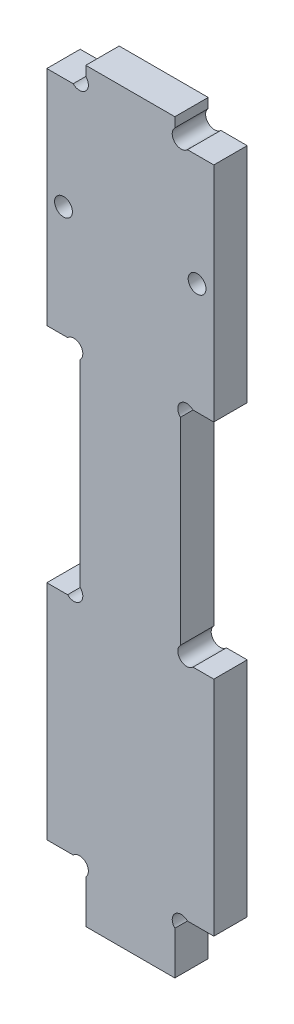
ISO-10303-21;
HEADER;
FILE_DESCRIPTION(('STEP AP214'),'2;1');
FILE_NAME('part.step','',(''),(''),'','','');
FILE_SCHEMA(('AUTOMOTIVE_DESIGN { 1 0 10303 214 1 1 1 1 }'));
ENDSEC;
DATA;
#1=APPLICATION_CONTEXT('core data for automotive mechanical design processes');
#2=APPLICATION_PROTOCOL_DEFINITION('international standard','automotive_design',2000,#1);
#3=PRODUCT_CONTEXT('',#1,'mechanical');
#4=PRODUCT('Part','Part','',(#3));
#5=PRODUCT_RELATED_PRODUCT_CATEGORY('part','',(#4));
#6=PRODUCT_DEFINITION_FORMATION('','',#4);
#7=PRODUCT_DEFINITION_CONTEXT('part definition',#1,'design');
#8=PRODUCT_DEFINITION('design','',#6,#7);
#9=PRODUCT_DEFINITION_SHAPE('','',#8);
#10=(LENGTH_UNIT() NAMED_UNIT(*) SI_UNIT(.MILLI.,.METRE.));
#11=(NAMED_UNIT(*) PLANE_ANGLE_UNIT() SI_UNIT($,.RADIAN.));
#12=(NAMED_UNIT(*) SI_UNIT($,.STERADIAN.) SOLID_ANGLE_UNIT());
#13=UNCERTAINTY_MEASURE_WITH_UNIT(LENGTH_MEASURE(1.E-05),#10,'distance_accuracy_value','');
#14=(GEOMETRIC_REPRESENTATION_CONTEXT(3) GLOBAL_UNCERTAINTY_ASSIGNED_CONTEXT((#13)) GLOBAL_UNIT_ASSIGNED_CONTEXT((#10,
#11,#12)) REPRESENTATION_CONTEXT('',''));
#15=CARTESIAN_POINT('',(0.,0.,0.));
#16=DIRECTION('',(0.,0.,1.));
#17=DIRECTION('',(1.,0.,0.));
#18=AXIS2_PLACEMENT_3D('',#15,#16,#17);
#19=CARTESIAN_POINT('',(24.1313708498985,8.86862915010153,6.));
#20=DIRECTION('',(0.,0.,1.));
#21=DIRECTION('',(1.,0.,0.));
#22=AXIS2_PLACEMENT_3D('',#19,#20,#21);
#23=PLANE('',#22);
#24=CARTESIAN_POINT('',(27.,110.,6.));
#25=DIRECTION('',(0.,0.,1.));
#26=DIRECTION('',(-1.,0.,0.));
#27=AXIS2_PLACEMENT_3D('',#24,#25,#26);
#28=CIRCLE('',#27,1.6);
#29=CARTESIAN_POINT('',(25.4,110.,6.));
#30=VERTEX_POINT('',#29);
#31=EDGE_CURVE('E232',#30,#30,#28,.T.);
#32=ORIENTED_EDGE('',*,*,#31,.F.);
#33=EDGE_LOOP('',(#32));
#34=FACE_BOUND('',#33,.T.);
#35=DIRECTION('',(0.,1.,0.));
#36=VECTOR('',#35,1.);
#37=CARTESIAN_POINT('',(30.,50.,6.));
#38=LINE('',#37,#36);
#39=CARTESIAN_POINT('',(30.,10.,6.));
#40=VERTEX_POINT('',#39);
#41=CARTESIAN_POINT('',(30.,50.,6.));
#42=VERTEX_POINT('',#41);
#43=EDGE_CURVE('E290',#40,#42,#38,.T.);
#44=ORIENTED_EDGE('',*,*,#43,.T.);
#45=DIRECTION('',(-1.,0.,0.));
#46=VECTOR('',#45,1.);
#47=CARTESIAN_POINT('',(26.262741699797,50.,6.));
#48=LINE('',#47,#46);
#49=CARTESIAN_POINT('',(26.262741699797,50.,6.));
#50=VERTEX_POINT('',#49);
#51=EDGE_CURVE('E227',#42,#50,#48,.T.);
#52=ORIENTED_EDGE('',*,*,#51,.T.);
#53=CARTESIAN_POINT('',(25.1313708498985,51.1313708498985,6.));
#54=DIRECTION('',(0.,0.,-1.));
#55=DIRECTION('',(1.,0.,0.));
#56=AXIS2_PLACEMENT_3D('',#53,#54,#55);
#57=CIRCLE('',#56,1.6);
#58=CARTESIAN_POINT('',(24.,52.2627416997969,6.));
#59=VERTEX_POINT('',#58);
#60=EDGE_CURVE('E293',#50,#59,#57,.T.);
#61=ORIENTED_EDGE('',*,*,#60,.T.);
#62=DIRECTION('',(0.,1.,0.));
#63=VECTOR('',#62,1.);
#64=CARTESIAN_POINT('',(24.,87.7372583002031,6.));
#65=LINE('',#64,#63);
#66=CARTESIAN_POINT('',(24.,87.7372583002031,6.));
#67=VERTEX_POINT('',#66);
#68=EDGE_CURVE('E295',#59,#67,#65,.T.);
#69=ORIENTED_EDGE('',*,*,#68,.T.);
#70=CARTESIAN_POINT('',(25.1313708498985,88.8686291501015,6.));
#71=DIRECTION('',(0.,0.,-1.));
#72=DIRECTION('',(-1.,0.,0.));
#73=AXIS2_PLACEMENT_3D('',#70,#71,#72);
#74=CIRCLE('',#73,1.6);
#75=CARTESIAN_POINT('',(26.262741699797,90.,6.));
#76=VERTEX_POINT('',#75);
#77=EDGE_CURVE('E297',#67,#76,#74,.T.);
#78=ORIENTED_EDGE('',*,*,#77,.T.);
#79=DIRECTION('',(1.,0.,0.));
#80=VECTOR('',#79,1.);
#81=CARTESIAN_POINT('',(26.262741699797,90.,6.));
#82=LINE('',#81,#80);
#83=CARTESIAN_POINT('',(30.,90.,6.));
#84=VERTEX_POINT('',#83);
#85=EDGE_CURVE('E299',#76,#84,#82,.T.);
#86=ORIENTED_EDGE('',*,*,#85,.T.);
#87=DIRECTION('',(0.,1.,0.));
#88=VECTOR('',#87,1.);
#89=CARTESIAN_POINT('',(30.,90.,6.));
#90=LINE('',#89,#88);
#91=CARTESIAN_POINT('',(30.,130.,6.));
#92=VERTEX_POINT('',#91);
#93=EDGE_CURVE('E301',#84,#92,#90,.T.);
#94=ORIENTED_EDGE('',*,*,#93,.T.);
#95=DIRECTION('',(-1.,0.,0.));
#96=VECTOR('',#95,1.);
#97=CARTESIAN_POINT('',(25.262741699797,130.,6.));
#98=LINE('',#97,#96);
#99=CARTESIAN_POINT('',(25.262741699797,130.,6.));
#100=VERTEX_POINT('',#99);
#101=EDGE_CURVE('E303',#92,#100,#98,.T.);
#102=ORIENTED_EDGE('',*,*,#101,.T.);
#103=CARTESIAN_POINT('',(24.1313708498985,131.131370849898,6.));
#104=DIRECTION('',(0.,0.,-1.));
#105=DIRECTION('',(-1.,0.,0.));
#106=AXIS2_PLACEMENT_3D('',#103,#104,#105);
#107=CIRCLE('',#106,1.60000000000001);
#108=CARTESIAN_POINT('',(23.,132.262741699797,6.));
#109=VERTEX_POINT('',#108);
#110=EDGE_CURVE('E305',#100,#109,#107,.T.);
#111=ORIENTED_EDGE('',*,*,#110,.T.);
#112=DIRECTION('',(0.,1.,0.));
#113=VECTOR('',#112,1.);
#114=CARTESIAN_POINT('',(23.,132.262741699797,6.));
#115=LINE('',#114,#113);
#116=CARTESIAN_POINT('',(23.,134.,6.));
#117=VERTEX_POINT('',#116);
#118=EDGE_CURVE('E307',#109,#117,#115,.T.);
#119=ORIENTED_EDGE('',*,*,#118,.T.);
#120=DIRECTION('',(-1.,0.,0.));
#121=VECTOR('',#120,1.);
#122=CARTESIAN_POINT('',(6.99999999999998,134.,6.));
#123=LINE('',#122,#121);
#124=CARTESIAN_POINT('',(6.99999999999998,134.,6.));
#125=VERTEX_POINT('',#124);
#126=EDGE_CURVE('E309',#117,#125,#123,.T.);
#127=ORIENTED_EDGE('',*,*,#126,.T.);
#128=DIRECTION('',(0.,-1.,0.));
#129=VECTOR('',#128,1.);
#130=CARTESIAN_POINT('',(6.99999999999998,132.262741699797,6.));
#131=LINE('',#130,#129);
#132=CARTESIAN_POINT('',(6.99999999999998,132.262741699797,6.));
#133=VERTEX_POINT('',#132);
#134=EDGE_CURVE('E311',#125,#133,#131,.T.);
#135=ORIENTED_EDGE('',*,*,#134,.T.);
#136=CARTESIAN_POINT('',(5.8686291501015,131.131370849898,6.));
#137=DIRECTION('',(0.,0.,-1.));
#138=DIRECTION('',(1.,0.,0.));
#139=AXIS2_PLACEMENT_3D('',#136,#137,#138);
#140=CIRCLE('',#139,1.60000000000001);
#141=CARTESIAN_POINT('',(4.73725830020302,130.,6.));
#142=VERTEX_POINT('',#141);
#143=EDGE_CURVE('E313',#133,#142,#140,.T.);
#144=ORIENTED_EDGE('',*,*,#143,.T.);
#145=DIRECTION('',(-1.,0.,0.));
#146=VECTOR('',#145,1.);
#147=CARTESIAN_POINT('',(4.73725830020302,130.,6.));
#148=LINE('',#147,#146);
#149=CARTESIAN_POINT('',(0.,130.,6.));
#150=VERTEX_POINT('',#149);
#151=EDGE_CURVE('E315',#142,#150,#148,.T.);
#152=ORIENTED_EDGE('',*,*,#151,.T.);
#153=DIRECTION('',(0.,-1.,0.));
#154=VECTOR('',#153,1.);
#155=CARTESIAN_POINT('',(0.,90.,6.));
#156=LINE('',#155,#154);
#157=CARTESIAN_POINT('',(0.,90.,6.));
#158=VERTEX_POINT('',#157);
#159=EDGE_CURVE('E317',#150,#158,#156,.T.);
#160=ORIENTED_EDGE('',*,*,#159,.T.);
#161=DIRECTION('',(1.,0.,0.));
#162=VECTOR('',#161,1.);
#163=CARTESIAN_POINT('',(3.73725830020305,90.,6.));
#164=LINE('',#163,#162);
#165=CARTESIAN_POINT('',(3.73725830020305,90.,6.));
#166=VERTEX_POINT('',#165);
#167=EDGE_CURVE('E319',#158,#166,#164,.T.);
#168=ORIENTED_EDGE('',*,*,#167,.T.);
#169=CARTESIAN_POINT('',(4.86862915010152,88.8686291501015,6.));
#170=DIRECTION('',(0.,0.,-1.));
#171=DIRECTION('',(1.,0.,0.));
#172=AXIS2_PLACEMENT_3D('',#169,#170,#171);
#173=CIRCLE('',#172,1.6);
#174=CARTESIAN_POINT('',(6.,87.7372583002031,6.));
#175=VERTEX_POINT('',#174);
#176=EDGE_CURVE('E321',#166,#175,#173,.T.);
#177=ORIENTED_EDGE('',*,*,#176,.T.);
#178=DIRECTION('',(0.,-1.,0.));
#179=VECTOR('',#178,1.);
#180=CARTESIAN_POINT('',(6.,87.7372583002031,6.));
#181=LINE('',#180,#179);
#182=CARTESIAN_POINT('',(6.,52.2627416997969,6.));
#183=VERTEX_POINT('',#182);
#184=EDGE_CURVE('E323',#175,#183,#181,.T.);
#185=ORIENTED_EDGE('',*,*,#184,.T.);
#186=CARTESIAN_POINT('',(4.86862915010152,51.1313708498985,6.));
#187=DIRECTION('',(0.,0.,-1.));
#188=DIRECTION('',(-1.,0.,0.));
#189=AXIS2_PLACEMENT_3D('',#186,#187,#188);
#190=CIRCLE('',#189,1.6);
#191=CARTESIAN_POINT('',(3.73725830020305,50.,6.));
#192=VERTEX_POINT('',#191);
#193=EDGE_CURVE('E325',#183,#192,#190,.T.);
#194=ORIENTED_EDGE('',*,*,#193,.T.);
#195=DIRECTION('',(-1.,0.,0.));
#196=VECTOR('',#195,1.);
#197=CARTESIAN_POINT('',(3.73725830020305,50.,6.));
#198=LINE('',#197,#196);
#199=CARTESIAN_POINT('',(0.,50.,6.));
#200=VERTEX_POINT('',#199);
#201=EDGE_CURVE('E327',#192,#200,#198,.T.);
#202=ORIENTED_EDGE('',*,*,#201,.T.);
#203=DIRECTION('',(0.,-1.,0.));
#204=VECTOR('',#203,1.);
#205=CARTESIAN_POINT('',(0.,50.,6.));
#206=LINE('',#205,#204);
#207=CARTESIAN_POINT('',(0.,10.,6.));
#208=VERTEX_POINT('',#207);
#209=EDGE_CURVE('E329',#200,#208,#206,.T.);
#210=ORIENTED_EDGE('',*,*,#209,.T.);
#211=DIRECTION('',(1.,0.,0.));
#212=VECTOR('',#211,1.);
#213=CARTESIAN_POINT('',(4.73725830020302,10.,6.));
#214=LINE('',#213,#212);
#215=CARTESIAN_POINT('',(4.73725830020302,10.,6.));
#216=VERTEX_POINT('',#215);
#217=EDGE_CURVE('E331',#208,#216,#214,.T.);
#218=ORIENTED_EDGE('',*,*,#217,.T.);
#219=CARTESIAN_POINT('',(5.8686291501015,8.86862915010153,6.));
#220=DIRECTION('',(0.,0.,-1.));
#221=DIRECTION('',(-1.,0.,0.));
#222=AXIS2_PLACEMENT_3D('',#219,#220,#221);
#223=CIRCLE('',#222,1.6);
#224=CARTESIAN_POINT('',(6.99999999999998,7.73725830020306,6.));
#225=VERTEX_POINT('',#224);
#226=EDGE_CURVE('E333',#216,#225,#223,.T.);
#227=ORIENTED_EDGE('',*,*,#226,.T.);
#228=DIRECTION('',(0.,-1.,0.));
#229=VECTOR('',#228,1.);
#230=CARTESIAN_POINT('',(6.99999999999998,7.73725830020306,6.));
#231=LINE('',#230,#229);
#232=CARTESIAN_POINT('',(6.99999999999998,0.,6.));
#233=VERTEX_POINT('',#232);
#234=EDGE_CURVE('E335',#225,#233,#231,.T.);
#235=ORIENTED_EDGE('',*,*,#234,.T.);
#236=DIRECTION('',(1.,0.,0.));
#237=VECTOR('',#236,1.);
#238=CARTESIAN_POINT('',(6.99999999999998,0.,6.));
#239=LINE('',#238,#237);
#240=CARTESIAN_POINT('',(23.,0.,6.));
#241=VERTEX_POINT('',#240);
#242=EDGE_CURVE('E337',#233,#241,#239,.T.);
#243=ORIENTED_EDGE('',*,*,#242,.T.);
#244=DIRECTION('',(0.,1.,0.));
#245=VECTOR('',#244,1.);
#246=CARTESIAN_POINT('',(23.,7.73725830020306,6.));
#247=LINE('',#246,#245);
#248=CARTESIAN_POINT('',(23.,7.73725830020306,6.));
#249=VERTEX_POINT('',#248);
#250=EDGE_CURVE('E339',#241,#249,#247,.T.);
#251=ORIENTED_EDGE('',*,*,#250,.T.);
#252=CARTESIAN_POINT('',(24.1313708498985,8.86862915010153,6.));
#253=DIRECTION('',(0.,0.,-1.));
#254=DIRECTION('',(1.,0.,0.));
#255=AXIS2_PLACEMENT_3D('',#252,#253,#254);
#256=CIRCLE('',#255,1.6);
#257=CARTESIAN_POINT('',(25.262741699797,10.,6.));
#258=VERTEX_POINT('',#257);
#259=EDGE_CURVE('E48',#249,#258,#256,.T.);
#260=ORIENTED_EDGE('',*,*,#259,.T.);
#261=DIRECTION('',(1.,0.,0.));
#262=VECTOR('',#261,1.);
#263=CARTESIAN_POINT('',(25.262741699797,10.,6.));
#264=LINE('',#263,#262);
#265=EDGE_CURVE('E43',#258,#40,#264,.T.);
#266=ORIENTED_EDGE('',*,*,#265,.T.);
#267=EDGE_LOOP('',(#44,#52,#61,#69,#78,#86,#94,#102,#111,#119,#127,#135,#144,#152,#160,#168,
#177,#185,#194,#202,#210,#218,#227,#235,#243,#251,#260,#266));
#268=FACE_BOUND('',#267,.T.);
#269=CARTESIAN_POINT('',(3.,110.,6.));
#270=DIRECTION('',(0.,0.,1.));
#271=DIRECTION('',(1.,0.,0.));
#272=AXIS2_PLACEMENT_3D('',#269,#270,#271);
#273=CIRCLE('',#272,1.6);
#274=CARTESIAN_POINT('',(4.6,110.,6.));
#275=VERTEX_POINT('',#274);
#276=EDGE_CURVE('E570',#275,#275,#273,.T.);
#277=ORIENTED_EDGE('',*,*,#276,.F.);
#278=EDGE_LOOP('',(#277));
#279=FACE_BOUND('',#278,.T.);
#280=ADVANCED_FACE('F28',(#34,#268,#279),#23,.T.);
#281=CARTESIAN_POINT('',(24.1313708498985,8.86862915010153,0.));
#282=DIRECTION('',(0.,0.,1.));
#283=DIRECTION('',(1.,0.,0.));
#284=AXIS2_PLACEMENT_3D('',#281,#282,#283);
#285=PLANE('',#284);
#286=CARTESIAN_POINT('',(27.,110.,0.));
#287=DIRECTION('',(0.,0.,1.));
#288=DIRECTION('',(-1.,0.,0.));
#289=AXIS2_PLACEMENT_3D('',#286,#287,#288);
#290=CIRCLE('',#289,1.6);
#291=CARTESIAN_POINT('',(25.4,110.,0.));
#292=VERTEX_POINT('',#291);
#293=EDGE_CURVE('E235',#292,#292,#290,.T.);
#294=ORIENTED_EDGE('',*,*,#293,.T.);
#295=EDGE_LOOP('',(#294));
#296=FACE_BOUND('',#295,.T.);
#297=DIRECTION('',(0.,1.,0.));
#298=VECTOR('',#297,1.);
#299=CARTESIAN_POINT('',(30.,50.,0.));
#300=LINE('',#299,#298);
#301=CARTESIAN_POINT('',(30.,10.,0.));
#302=VERTEX_POINT('',#301);
#303=CARTESIAN_POINT('',(30.,50.,0.));
#304=VERTEX_POINT('',#303);
#305=EDGE_CURVE('E218',#302,#304,#300,.T.);
#306=ORIENTED_EDGE('',*,*,#305,.F.);
#307=DIRECTION('',(1.,0.,0.));
#308=VECTOR('',#307,1.);
#309=CARTESIAN_POINT('',(25.262741699797,10.,0.));
#310=LINE('',#309,#308);
#311=CARTESIAN_POINT('',(25.262741699797,10.,0.));
#312=VERTEX_POINT('',#311);
#313=EDGE_CURVE('E288',#312,#302,#310,.T.);
#314=ORIENTED_EDGE('',*,*,#313,.F.);
#315=CARTESIAN_POINT('',(24.1313708498985,8.86862915010153,0.));
#316=DIRECTION('',(0.,0.,-1.));
#317=DIRECTION('',(1.,0.,0.));
#318=AXIS2_PLACEMENT_3D('',#315,#316,#317);
#319=CIRCLE('',#318,1.6);
#320=CARTESIAN_POINT('',(23.,7.73725830020306,0.));
#321=VERTEX_POINT('',#320);
#322=EDGE_CURVE('E286',#321,#312,#319,.T.);
#323=ORIENTED_EDGE('',*,*,#322,.F.);
#324=DIRECTION('',(0.,1.,0.));
#325=VECTOR('',#324,1.);
#326=CARTESIAN_POINT('',(23.,7.73725830020306,0.));
#327=LINE('',#326,#325);
#328=CARTESIAN_POINT('',(23.,0.,0.));
#329=VERTEX_POINT('',#328);
#330=EDGE_CURVE('E284',#329,#321,#327,.T.);
#331=ORIENTED_EDGE('',*,*,#330,.F.);
#332=DIRECTION('',(1.,0.,0.));
#333=VECTOR('',#332,1.);
#334=CARTESIAN_POINT('',(6.99999999999998,0.,0.));
#335=LINE('',#334,#333);
#336=CARTESIAN_POINT('',(6.99999999999998,0.,0.));
#337=VERTEX_POINT('',#336);
#338=EDGE_CURVE('E282',#337,#329,#335,.T.);
#339=ORIENTED_EDGE('',*,*,#338,.F.);
#340=DIRECTION('',(0.,-1.,0.));
#341=VECTOR('',#340,1.);
#342=CARTESIAN_POINT('',(6.99999999999998,7.73725830020306,0.));
#343=LINE('',#342,#341);
#344=CARTESIAN_POINT('',(6.99999999999998,7.73725830020306,0.));
#345=VERTEX_POINT('',#344);
#346=EDGE_CURVE('E280',#345,#337,#343,.T.);
#347=ORIENTED_EDGE('',*,*,#346,.F.);
#348=CARTESIAN_POINT('',(5.8686291501015,8.86862915010153,0.));
#349=DIRECTION('',(0.,0.,-1.));
#350=DIRECTION('',(-1.,0.,0.));
#351=AXIS2_PLACEMENT_3D('',#348,#349,#350);
#352=CIRCLE('',#351,1.6);
#353=CARTESIAN_POINT('',(4.73725830020302,10.,0.));
#354=VERTEX_POINT('',#353);
#355=EDGE_CURVE('E278',#354,#345,#352,.T.);
#356=ORIENTED_EDGE('',*,*,#355,.F.);
#357=DIRECTION('',(1.,0.,0.));
#358=VECTOR('',#357,1.);
#359=CARTESIAN_POINT('',(4.73725830020302,10.,0.));
#360=LINE('',#359,#358);
#361=CARTESIAN_POINT('',(0.,10.,0.));
#362=VERTEX_POINT('',#361);
#363=EDGE_CURVE('E276',#362,#354,#360,.T.);
#364=ORIENTED_EDGE('',*,*,#363,.F.);
#365=DIRECTION('',(0.,-1.,0.));
#366=VECTOR('',#365,1.);
#367=CARTESIAN_POINT('',(0.,50.,0.));
#368=LINE('',#367,#366);
#369=CARTESIAN_POINT('',(0.,50.,0.));
#370=VERTEX_POINT('',#369);
#371=EDGE_CURVE('E274',#370,#362,#368,.T.);
#372=ORIENTED_EDGE('',*,*,#371,.F.);
#373=DIRECTION('',(-1.,0.,0.));
#374=VECTOR('',#373,1.);
#375=CARTESIAN_POINT('',(3.73725830020305,50.,0.));
#376=LINE('',#375,#374);
#377=CARTESIAN_POINT('',(3.73725830020305,50.,0.));
#378=VERTEX_POINT('',#377);
#379=EDGE_CURVE('E272',#378,#370,#376,.T.);
#380=ORIENTED_EDGE('',*,*,#379,.F.);
#381=CARTESIAN_POINT('',(4.86862915010152,51.1313708498985,0.));
#382=DIRECTION('',(0.,0.,-1.));
#383=DIRECTION('',(-1.,0.,0.));
#384=AXIS2_PLACEMENT_3D('',#381,#382,#383);
#385=CIRCLE('',#384,1.6);
#386=CARTESIAN_POINT('',(6.,52.2627416997969,0.));
#387=VERTEX_POINT('',#386);
#388=EDGE_CURVE('E270',#387,#378,#385,.T.);
#389=ORIENTED_EDGE('',*,*,#388,.F.);
#390=DIRECTION('',(0.,-1.,0.));
#391=VECTOR('',#390,1.);
#392=CARTESIAN_POINT('',(6.,87.7372583002031,0.));
#393=LINE('',#392,#391);
#394=CARTESIAN_POINT('',(6.,87.7372583002031,0.));
#395=VERTEX_POINT('',#394);
#396=EDGE_CURVE('E268',#395,#387,#393,.T.);
#397=ORIENTED_EDGE('',*,*,#396,.F.);
#398=CARTESIAN_POINT('',(4.86862915010152,88.8686291501015,0.));
#399=DIRECTION('',(0.,0.,-1.));
#400=DIRECTION('',(1.,0.,0.));
#401=AXIS2_PLACEMENT_3D('',#398,#399,#400);
#402=CIRCLE('',#401,1.6);
#403=CARTESIAN_POINT('',(3.73725830020305,90.,0.));
#404=VERTEX_POINT('',#403);
#405=EDGE_CURVE('E266',#404,#395,#402,.T.);
#406=ORIENTED_EDGE('',*,*,#405,.F.);
#407=DIRECTION('',(1.,0.,0.));
#408=VECTOR('',#407,1.);
#409=CARTESIAN_POINT('',(3.73725830020305,90.,0.));
#410=LINE('',#409,#408);
#411=CARTESIAN_POINT('',(0.,90.,0.));
#412=VERTEX_POINT('',#411);
#413=EDGE_CURVE('E264',#412,#404,#410,.T.);
#414=ORIENTED_EDGE('',*,*,#413,.F.);
#415=DIRECTION('',(0.,-1.,0.));
#416=VECTOR('',#415,1.);
#417=CARTESIAN_POINT('',(0.,90.,0.));
#418=LINE('',#417,#416);
#419=CARTESIAN_POINT('',(0.,130.,0.));
#420=VERTEX_POINT('',#419);
#421=EDGE_CURVE('E262',#420,#412,#418,.T.);
#422=ORIENTED_EDGE('',*,*,#421,.F.);
#423=DIRECTION('',(-1.,0.,0.));
#424=VECTOR('',#423,1.);
#425=CARTESIAN_POINT('',(4.73725830020302,130.,0.));
#426=LINE('',#425,#424);
#427=CARTESIAN_POINT('',(4.73725830020302,130.,0.));
#428=VERTEX_POINT('',#427);
#429=EDGE_CURVE('E260',#428,#420,#426,.T.);
#430=ORIENTED_EDGE('',*,*,#429,.F.);
#431=CARTESIAN_POINT('',(5.8686291501015,131.131370849898,0.));
#432=DIRECTION('',(0.,0.,-1.));
#433=DIRECTION('',(1.,0.,0.));
#434=AXIS2_PLACEMENT_3D('',#431,#432,#433);
#435=CIRCLE('',#434,1.60000000000001);
#436=CARTESIAN_POINT('',(6.99999999999998,132.262741699797,0.));
#437=VERTEX_POINT('',#436);
#438=EDGE_CURVE('E258',#437,#428,#435,.T.);
#439=ORIENTED_EDGE('',*,*,#438,.F.);
#440=DIRECTION('',(0.,-1.,0.));
#441=VECTOR('',#440,1.);
#442=CARTESIAN_POINT('',(6.99999999999998,132.262741699797,0.));
#443=LINE('',#442,#441);
#444=CARTESIAN_POINT('',(6.99999999999998,134.,0.));
#445=VERTEX_POINT('',#444);
#446=EDGE_CURVE('E256',#445,#437,#443,.T.);
#447=ORIENTED_EDGE('',*,*,#446,.F.);
#448=DIRECTION('',(-1.,0.,0.));
#449=VECTOR('',#448,1.);
#450=CARTESIAN_POINT('',(6.99999999999998,134.,0.));
#451=LINE('',#450,#449);
#452=CARTESIAN_POINT('',(23.,134.,0.));
#453=VERTEX_POINT('',#452);
#454=EDGE_CURVE('E254',#453,#445,#451,.T.);
#455=ORIENTED_EDGE('',*,*,#454,.F.);
#456=DIRECTION('',(0.,1.,0.));
#457=VECTOR('',#456,1.);
#458=CARTESIAN_POINT('',(23.,132.262741699797,0.));
#459=LINE('',#458,#457);
#460=CARTESIAN_POINT('',(23.,132.262741699797,0.));
#461=VERTEX_POINT('',#460);
#462=EDGE_CURVE('E252',#461,#453,#459,.T.);
#463=ORIENTED_EDGE('',*,*,#462,.F.);
#464=CARTESIAN_POINT('',(24.1313708498985,131.131370849898,0.));
#465=DIRECTION('',(0.,0.,-1.));
#466=DIRECTION('',(-1.,0.,0.));
#467=AXIS2_PLACEMENT_3D('',#464,#465,#466);
#468=CIRCLE('',#467,1.60000000000001);
#469=CARTESIAN_POINT('',(25.262741699797,130.,0.));
#470=VERTEX_POINT('',#469);
#471=EDGE_CURVE('E250',#470,#461,#468,.T.);
#472=ORIENTED_EDGE('',*,*,#471,.F.);
#473=DIRECTION('',(-1.,0.,0.));
#474=VECTOR('',#473,1.);
#475=CARTESIAN_POINT('',(25.262741699797,130.,0.));
#476=LINE('',#475,#474);
#477=CARTESIAN_POINT('',(30.,130.,0.));
#478=VERTEX_POINT('',#477);
#479=EDGE_CURVE('E248',#478,#470,#476,.T.);
#480=ORIENTED_EDGE('',*,*,#479,.F.);
#481=DIRECTION('',(0.,1.,0.));
#482=VECTOR('',#481,1.);
#483=CARTESIAN_POINT('',(30.,90.,0.));
#484=LINE('',#483,#482);
#485=CARTESIAN_POINT('',(30.,90.,0.));
#486=VERTEX_POINT('',#485);
#487=EDGE_CURVE('E246',#486,#478,#484,.T.);
#488=ORIENTED_EDGE('',*,*,#487,.F.);
#489=DIRECTION('',(1.,0.,0.));
#490=VECTOR('',#489,1.);
#491=CARTESIAN_POINT('',(26.262741699797,90.,0.));
#492=LINE('',#491,#490);
#493=CARTESIAN_POINT('',(26.262741699797,90.,0.));
#494=VERTEX_POINT('',#493);
#495=EDGE_CURVE('E244',#494,#486,#492,.T.);
#496=ORIENTED_EDGE('',*,*,#495,.F.);
#497=CARTESIAN_POINT('',(25.1313708498985,88.8686291501015,0.));
#498=DIRECTION('',(0.,0.,-1.));
#499=DIRECTION('',(-1.,0.,0.));
#500=AXIS2_PLACEMENT_3D('',#497,#498,#499);
#501=CIRCLE('',#500,1.6);
#502=CARTESIAN_POINT('',(24.,87.7372583002031,0.));
#503=VERTEX_POINT('',#502);
#504=EDGE_CURVE('E242',#503,#494,#501,.T.);
#505=ORIENTED_EDGE('',*,*,#504,.F.);
#506=DIRECTION('',(0.,1.,0.));
#507=VECTOR('',#506,1.);
#508=CARTESIAN_POINT('',(24.,87.7372583002031,0.));
#509=LINE('',#508,#507);
#510=CARTESIAN_POINT('',(24.,52.2627416997969,0.));
#511=VERTEX_POINT('',#510);
#512=EDGE_CURVE('E240',#511,#503,#509,.T.);
#513=ORIENTED_EDGE('',*,*,#512,.F.);
#514=CARTESIAN_POINT('',(25.1313708498985,51.1313708498985,0.));
#515=DIRECTION('',(0.,0.,-1.));
#516=DIRECTION('',(1.,0.,0.));
#517=AXIS2_PLACEMENT_3D('',#514,#515,#516);
#518=CIRCLE('',#517,1.6);
#519=CARTESIAN_POINT('',(26.262741699797,50.,0.));
#520=VERTEX_POINT('',#519);
#521=EDGE_CURVE('E220',#520,#511,#518,.T.);
#522=ORIENTED_EDGE('',*,*,#521,.F.);
#523=DIRECTION('',(-1.,0.,0.));
#524=VECTOR('',#523,1.);
#525=CARTESIAN_POINT('',(26.262741699797,50.,0.));
#526=LINE('',#525,#524);
#527=EDGE_CURVE('E213',#304,#520,#526,.T.);
#528=ORIENTED_EDGE('',*,*,#527,.F.);
#529=EDGE_LOOP('',(#306,#314,#323,#331,#339,#347,#356,#364,#372,#380,#389,#397,#406,#414,#422,
#430,#439,#447,#455,#463,#472,#480,#488,#496,#505,#513,#522,#528));
#530=FACE_BOUND('',#529,.T.);
#531=CARTESIAN_POINT('',(3.,110.,0.));
#532=DIRECTION('',(0.,0.,1.));
#533=DIRECTION('',(1.,0.,0.));
#534=AXIS2_PLACEMENT_3D('',#531,#532,#533);
#535=CIRCLE('',#534,1.6);
#536=CARTESIAN_POINT('',(4.6,110.,0.));
#537=VERTEX_POINT('',#536);
#538=EDGE_CURVE('E573',#537,#537,#535,.T.);
#539=ORIENTED_EDGE('',*,*,#538,.T.);
#540=EDGE_LOOP('',(#539));
#541=FACE_BOUND('',#540,.T.);
#542=ADVANCED_FACE('F214',(#296,#530,#541),#285,.F.);
#543=CARTESIAN_POINT('',(30.,50.,6.));
#544=DIRECTION('',(-1.,0.,0.));
#545=DIRECTION('',(0.,0.,1.));
#546=AXIS2_PLACEMENT_3D('',#543,#544,#545);
#547=PLANE('',#546);
#548=ORIENTED_EDGE('',*,*,#305,.T.);
#549=DIRECTION('',(0.,0.,-1.));
#550=VECTOR('',#549,1.);
#551=CARTESIAN_POINT('',(30.,50.,6.));
#552=LINE('',#551,#550);
#553=EDGE_CURVE('E11',#42,#304,#552,.T.);
#554=ORIENTED_EDGE('',*,*,#553,.F.);
#555=ORIENTED_EDGE('',*,*,#43,.F.);
#556=DIRECTION('',(0.,0.,-1.));
#557=VECTOR('',#556,1.);
#558=CARTESIAN_POINT('',(30.,10.,6.));
#559=LINE('',#558,#557);
#560=EDGE_CURVE('E231',#40,#302,#559,.T.);
#561=ORIENTED_EDGE('',*,*,#560,.T.);
#562=EDGE_LOOP('',(#548,#554,#555,#561));
#563=FACE_BOUND('',#562,.T.);
#564=ADVANCED_FACE('F30',(#563),#547,.F.);
#565=CARTESIAN_POINT('',(26.262741699797,50.,6.));
#566=DIRECTION('',(0.,-1.,0.));
#567=DIRECTION('',(1.,0.,0.));
#568=AXIS2_PLACEMENT_3D('',#565,#566,#567);
#569=PLANE('',#568);
#570=ORIENTED_EDGE('',*,*,#527,.T.);
#571=DIRECTION('',(0.,0.,-1.));
#572=VECTOR('',#571,1.);
#573=CARTESIAN_POINT('',(26.262741699797,50.,6.));
#574=LINE('',#573,#572);
#575=EDGE_CURVE('E36',#50,#520,#574,.T.);
#576=ORIENTED_EDGE('',*,*,#575,.F.);
#577=ORIENTED_EDGE('',*,*,#51,.F.);
#578=ORIENTED_EDGE('',*,*,#553,.T.);
#579=EDGE_LOOP('',(#570,#576,#577,#578));
#580=FACE_BOUND('',#579,.T.);
#581=ADVANCED_FACE('F226',(#580),#569,.F.);
#582=CARTESIAN_POINT('',(25.1313708498985,51.1313708498985,6.));
#583=DIRECTION('',(0.,0.,-1.));
#584=DIRECTION('',(-1.,0.,0.));
#585=AXIS2_PLACEMENT_3D('',#582,#583,#584);
#586=CYLINDRICAL_SURFACE('',#585,1.6);
#587=ORIENTED_EDGE('',*,*,#521,.T.);
#588=DIRECTION('',(0.,0.,-1.));
#589=VECTOR('',#588,1.);
#590=CARTESIAN_POINT('',(24.,52.2627416997969,6.));
#591=LINE('',#590,#589);
#592=EDGE_CURVE('E416',#59,#511,#591,.T.);
#593=ORIENTED_EDGE('',*,*,#592,.F.);
#594=ORIENTED_EDGE('',*,*,#60,.F.);
#595=ORIENTED_EDGE('',*,*,#575,.T.);
#596=EDGE_LOOP('',(#587,#593,#594,#595));
#597=FACE_BOUND('',#596,.T.);
#598=ADVANCED_FACE('F420',(#597),#586,.F.);
#599=CARTESIAN_POINT('',(24.,87.7372583002031,6.));
#600=DIRECTION('',(-1.,0.,0.));
#601=DIRECTION('',(0.,0.,1.));
#602=AXIS2_PLACEMENT_3D('',#599,#600,#601);
#603=PLANE('',#602);
#604=ORIENTED_EDGE('',*,*,#512,.T.);
#605=DIRECTION('',(0.,0.,-1.));
#606=VECTOR('',#605,1.);
#607=CARTESIAN_POINT('',(24.,87.7372583002031,6.));
#608=LINE('',#607,#606);
#609=EDGE_CURVE('E413',#67,#503,#608,.T.);
#610=ORIENTED_EDGE('',*,*,#609,.F.);
#611=ORIENTED_EDGE('',*,*,#68,.F.);
#612=ORIENTED_EDGE('',*,*,#592,.T.);
#613=EDGE_LOOP('',(#604,#610,#611,#612));
#614=FACE_BOUND('',#613,.T.);
#615=ADVANCED_FACE('F428',(#614),#603,.F.);
#616=CARTESIAN_POINT('',(25.1313708498985,88.8686291501015,6.));
#617=DIRECTION('',(0.,0.,-1.));
#618=DIRECTION('',(-1.,0.,0.));
#619=AXIS2_PLACEMENT_3D('',#616,#617,#618);
#620=CYLINDRICAL_SURFACE('',#619,1.6);
#621=ORIENTED_EDGE('',*,*,#504,.T.);
#622=DIRECTION('',(0.,0.,-1.));
#623=VECTOR('',#622,1.);
#624=CARTESIAN_POINT('',(26.262741699797,90.,6.));
#625=LINE('',#624,#623);
#626=EDGE_CURVE('E410',#76,#494,#625,.T.);
#627=ORIENTED_EDGE('',*,*,#626,.F.);
#628=ORIENTED_EDGE('',*,*,#77,.F.);
#629=ORIENTED_EDGE('',*,*,#609,.T.);
#630=EDGE_LOOP('',(#621,#627,#628,#629));
#631=FACE_BOUND('',#630,.T.);
#632=ADVANCED_FACE('F431',(#631),#620,.F.);
#633=CARTESIAN_POINT('',(26.262741699797,90.,6.));
#634=DIRECTION('',(0.,1.,0.));
#635=DIRECTION('',(-1.,0.,0.));
#636=AXIS2_PLACEMENT_3D('',#633,#634,#635);
#637=PLANE('',#636);
#638=ORIENTED_EDGE('',*,*,#495,.T.);
#639=DIRECTION('',(0.,0.,-1.));
#640=VECTOR('',#639,1.);
#641=CARTESIAN_POINT('',(30.,90.,6.));
#642=LINE('',#641,#640);
#643=EDGE_CURVE('E407',#84,#486,#642,.T.);
#644=ORIENTED_EDGE('',*,*,#643,.F.);
#645=ORIENTED_EDGE('',*,*,#85,.F.);
#646=ORIENTED_EDGE('',*,*,#626,.T.);
#647=EDGE_LOOP('',(#638,#644,#645,#646));
#648=FACE_BOUND('',#647,.T.);
#649=ADVANCED_FACE('F436',(#648),#637,.F.);
#650=CARTESIAN_POINT('',(30.,90.,6.));
#651=DIRECTION('',(-1.,0.,0.));
#652=DIRECTION('',(0.,0.,1.));
#653=AXIS2_PLACEMENT_3D('',#650,#651,#652);
#654=PLANE('',#653);
#655=ORIENTED_EDGE('',*,*,#487,.T.);
#656=DIRECTION('',(0.,0.,-1.));
#657=VECTOR('',#656,1.);
#658=CARTESIAN_POINT('',(30.,130.,6.));
#659=LINE('',#658,#657);
#660=EDGE_CURVE('E404',#92,#478,#659,.T.);
#661=ORIENTED_EDGE('',*,*,#660,.F.);
#662=ORIENTED_EDGE('',*,*,#93,.F.);
#663=ORIENTED_EDGE('',*,*,#643,.T.);
#664=EDGE_LOOP('',(#655,#661,#662,#663));
#665=FACE_BOUND('',#664,.T.);
#666=ADVANCED_FACE('F442',(#665),#654,.F.);
#667=CARTESIAN_POINT('',(25.262741699797,130.,6.));
#668=DIRECTION('',(0.,-1.,0.));
#669=DIRECTION('',(0.,0.,-1.));
#670=AXIS2_PLACEMENT_3D('',#667,#668,#669);
#671=PLANE('',#670);
#672=ORIENTED_EDGE('',*,*,#479,.T.);
#673=DIRECTION('',(0.,0.,-1.));
#674=VECTOR('',#673,1.);
#675=CARTESIAN_POINT('',(25.262741699797,130.,6.));
#676=LINE('',#675,#674);
#677=EDGE_CURVE('E401',#100,#470,#676,.T.);
#678=ORIENTED_EDGE('',*,*,#677,.F.);
#679=ORIENTED_EDGE('',*,*,#101,.F.);
#680=ORIENTED_EDGE('',*,*,#660,.T.);
#681=EDGE_LOOP('',(#672,#678,#679,#680));
#682=FACE_BOUND('',#681,.T.);
#683=ADVANCED_FACE('F446',(#682),#671,.F.);
#684=CARTESIAN_POINT('',(24.1313708498985,131.131370849898,6.));
#685=DIRECTION('',(0.,0.,-1.));
#686=DIRECTION('',(-1.,0.,0.));
#687=AXIS2_PLACEMENT_3D('',#684,#685,#686);
#688=CYLINDRICAL_SURFACE('',#687,1.60000000000001);
#689=ORIENTED_EDGE('',*,*,#471,.T.);
#690=DIRECTION('',(0.,0.,-1.));
#691=VECTOR('',#690,1.);
#692=CARTESIAN_POINT('',(23.,132.262741699797,6.));
#693=LINE('',#692,#691);
#694=EDGE_CURVE('E398',#109,#461,#693,.T.);
#695=ORIENTED_EDGE('',*,*,#694,.F.);
#696=ORIENTED_EDGE('',*,*,#110,.F.);
#697=ORIENTED_EDGE('',*,*,#677,.T.);
#698=EDGE_LOOP('',(#689,#695,#696,#697));
#699=FACE_BOUND('',#698,.T.);
#700=ADVANCED_FACE('F451',(#699),#688,.F.);
#701=CARTESIAN_POINT('',(23.,132.262741699797,6.));
#702=DIRECTION('',(-1.,0.,0.));
#703=DIRECTION('',(0.,0.,1.));
#704=AXIS2_PLACEMENT_3D('',#701,#702,#703);
#705=PLANE('',#704);
#706=ORIENTED_EDGE('',*,*,#462,.T.);
#707=DIRECTION('',(0.,0.,-1.));
#708=VECTOR('',#707,1.);
#709=CARTESIAN_POINT('',(23.,134.,6.));
#710=LINE('',#709,#708);
#711=EDGE_CURVE('E395',#117,#453,#710,.T.);
#712=ORIENTED_EDGE('',*,*,#711,.F.);
#713=ORIENTED_EDGE('',*,*,#118,.F.);
#714=ORIENTED_EDGE('',*,*,#694,.T.);
#715=EDGE_LOOP('',(#706,#712,#713,#714));
#716=FACE_BOUND('',#715,.T.);
#717=ADVANCED_FACE('F457',(#716),#705,.F.);
#718=CARTESIAN_POINT('',(6.99999999999998,134.,6.));
#719=DIRECTION('',(0.,-1.,0.));
#720=DIRECTION('',(0.,0.,-1.));
#721=AXIS2_PLACEMENT_3D('',#718,#719,#720);
#722=PLANE('',#721);
#723=ORIENTED_EDGE('',*,*,#454,.T.);
#724=DIRECTION('',(0.,0.,-1.));
#725=VECTOR('',#724,1.);
#726=CARTESIAN_POINT('',(6.99999999999998,134.,6.));
#727=LINE('',#726,#725);
#728=EDGE_CURVE('E392',#125,#445,#727,.T.);
#729=ORIENTED_EDGE('',*,*,#728,.F.);
#730=ORIENTED_EDGE('',*,*,#126,.F.);
#731=ORIENTED_EDGE('',*,*,#711,.T.);
#732=EDGE_LOOP('',(#723,#729,#730,#731));
#733=FACE_BOUND('',#732,.T.);
#734=ADVANCED_FACE('F461',(#733),#722,.F.);
#735=CARTESIAN_POINT('',(6.99999999999998,132.262741699797,6.));
#736=DIRECTION('',(1.,0.,0.));
#737=DIRECTION('',(0.,0.,-1.));
#738=AXIS2_PLACEMENT_3D('',#735,#736,#737);
#739=PLANE('',#738);
#740=ORIENTED_EDGE('',*,*,#446,.T.);
#741=DIRECTION('',(0.,0.,-1.));
#742=VECTOR('',#741,1.);
#743=CARTESIAN_POINT('',(6.99999999999998,132.262741699797,6.));
#744=LINE('',#743,#742);
#745=EDGE_CURVE('E389',#133,#437,#744,.T.);
#746=ORIENTED_EDGE('',*,*,#745,.F.);
#747=ORIENTED_EDGE('',*,*,#134,.F.);
#748=ORIENTED_EDGE('',*,*,#728,.T.);
#749=EDGE_LOOP('',(#740,#746,#747,#748));
#750=FACE_BOUND('',#749,.T.);
#751=ADVANCED_FACE('F466',(#750),#739,.F.);
#752=CARTESIAN_POINT('',(5.8686291501015,131.131370849898,6.));
#753=DIRECTION('',(0.,0.,-1.));
#754=DIRECTION('',(-1.,0.,0.));
#755=AXIS2_PLACEMENT_3D('',#752,#753,#754);
#756=CYLINDRICAL_SURFACE('',#755,1.60000000000001);
#757=ORIENTED_EDGE('',*,*,#438,.T.);
#758=DIRECTION('',(0.,0.,-1.));
#759=VECTOR('',#758,1.);
#760=CARTESIAN_POINT('',(4.73725830020302,130.,6.));
#761=LINE('',#760,#759);
#762=EDGE_CURVE('E386',#142,#428,#761,.T.);
#763=ORIENTED_EDGE('',*,*,#762,.F.);
#764=ORIENTED_EDGE('',*,*,#143,.F.);
#765=ORIENTED_EDGE('',*,*,#745,.T.);
#766=EDGE_LOOP('',(#757,#763,#764,#765));
#767=FACE_BOUND('',#766,.T.);
#768=ADVANCED_FACE('F472',(#767),#756,.F.);
#769=CARTESIAN_POINT('',(4.73725830020302,130.,6.));
#770=DIRECTION('',(0.,-1.,0.));
#771=DIRECTION('',(0.,0.,-1.));
#772=AXIS2_PLACEMENT_3D('',#769,#770,#771);
#773=PLANE('',#772);
#774=ORIENTED_EDGE('',*,*,#429,.T.);
#775=DIRECTION('',(0.,0.,-1.));
#776=VECTOR('',#775,1.);
#777=CARTESIAN_POINT('',(0.,130.,6.));
#778=LINE('',#777,#776);
#779=EDGE_CURVE('E383',#150,#420,#778,.T.);
#780=ORIENTED_EDGE('',*,*,#779,.F.);
#781=ORIENTED_EDGE('',*,*,#151,.F.);
#782=ORIENTED_EDGE('',*,*,#762,.T.);
#783=EDGE_LOOP('',(#774,#780,#781,#782));
#784=FACE_BOUND('',#783,.T.);
#785=ADVANCED_FACE('F476',(#784),#773,.F.);
#786=CARTESIAN_POINT('',(0.,90.,6.));
#787=DIRECTION('',(1.,0.,0.));
#788=DIRECTION('',(0.,0.,-1.));
#789=AXIS2_PLACEMENT_3D('',#786,#787,#788);
#790=PLANE('',#789);
#791=ORIENTED_EDGE('',*,*,#421,.T.);
#792=DIRECTION('',(0.,0.,-1.));
#793=VECTOR('',#792,1.);
#794=CARTESIAN_POINT('',(0.,90.,6.));
#795=LINE('',#794,#793);
#796=EDGE_CURVE('E380',#158,#412,#795,.T.);
#797=ORIENTED_EDGE('',*,*,#796,.F.);
#798=ORIENTED_EDGE('',*,*,#159,.F.);
#799=ORIENTED_EDGE('',*,*,#779,.T.);
#800=EDGE_LOOP('',(#791,#797,#798,#799));
#801=FACE_BOUND('',#800,.T.);
#802=ADVANCED_FACE('F481',(#801),#790,.F.);
#803=CARTESIAN_POINT('',(3.73725830020305,90.,6.));
#804=DIRECTION('',(0.,1.,0.));
#805=DIRECTION('',(-1.,0.,0.));
#806=AXIS2_PLACEMENT_3D('',#803,#804,#805);
#807=PLANE('',#806);
#808=ORIENTED_EDGE('',*,*,#413,.T.);
#809=DIRECTION('',(0.,0.,-1.));
#810=VECTOR('',#809,1.);
#811=CARTESIAN_POINT('',(3.73725830020305,90.,6.));
#812=LINE('',#811,#810);
#813=EDGE_CURVE('E377',#166,#404,#812,.T.);
#814=ORIENTED_EDGE('',*,*,#813,.F.);
#815=ORIENTED_EDGE('',*,*,#167,.F.);
#816=ORIENTED_EDGE('',*,*,#796,.T.);
#817=EDGE_LOOP('',(#808,#814,#815,#816));
#818=FACE_BOUND('',#817,.T.);
#819=ADVANCED_FACE('F487',(#818),#807,.F.);
#820=CARTESIAN_POINT('',(4.86862915010152,88.8686291501015,6.));
#821=DIRECTION('',(0.,0.,-1.));
#822=DIRECTION('',(-1.,0.,0.));
#823=AXIS2_PLACEMENT_3D('',#820,#821,#822);
#824=CYLINDRICAL_SURFACE('',#823,1.6);
#825=ORIENTED_EDGE('',*,*,#405,.T.);
#826=DIRECTION('',(0.,0.,-1.));
#827=VECTOR('',#826,1.);
#828=CARTESIAN_POINT('',(6.,87.7372583002031,6.));
#829=LINE('',#828,#827);
#830=EDGE_CURVE('E374',#175,#395,#829,.T.);
#831=ORIENTED_EDGE('',*,*,#830,.F.);
#832=ORIENTED_EDGE('',*,*,#176,.F.);
#833=ORIENTED_EDGE('',*,*,#813,.T.);
#834=EDGE_LOOP('',(#825,#831,#832,#833));
#835=FACE_BOUND('',#834,.T.);
#836=ADVANCED_FACE('F491',(#835),#824,.F.);
#837=CARTESIAN_POINT('',(6.,87.7372583002031,6.));
#838=DIRECTION('',(1.,0.,0.));
#839=DIRECTION('',(0.,0.,-1.));
#840=AXIS2_PLACEMENT_3D('',#837,#838,#839);
#841=PLANE('',#840);
#842=ORIENTED_EDGE('',*,*,#396,.T.);
#843=DIRECTION('',(0.,0.,-1.));
#844=VECTOR('',#843,1.);
#845=CARTESIAN_POINT('',(6.,52.2627416997969,6.));
#846=LINE('',#845,#844);
#847=EDGE_CURVE('E371',#183,#387,#846,.T.);
#848=ORIENTED_EDGE('',*,*,#847,.F.);
#849=ORIENTED_EDGE('',*,*,#184,.F.);
#850=ORIENTED_EDGE('',*,*,#830,.T.);
#851=EDGE_LOOP('',(#842,#848,#849,#850));
#852=FACE_BOUND('',#851,.T.);
#853=ADVANCED_FACE('F496',(#852),#841,.F.);
#854=CARTESIAN_POINT('',(4.86862915010152,51.1313708498985,6.));
#855=DIRECTION('',(0.,0.,-1.));
#856=DIRECTION('',(-1.,0.,0.));
#857=AXIS2_PLACEMENT_3D('',#854,#855,#856);
#858=CYLINDRICAL_SURFACE('',#857,1.6);
#859=ORIENTED_EDGE('',*,*,#388,.T.);
#860=DIRECTION('',(0.,0.,-1.));
#861=VECTOR('',#860,1.);
#862=CARTESIAN_POINT('',(3.73725830020305,50.,6.));
#863=LINE('',#862,#861);
#864=EDGE_CURVE('E368',#192,#378,#863,.T.);
#865=ORIENTED_EDGE('',*,*,#864,.F.);
#866=ORIENTED_EDGE('',*,*,#193,.F.);
#867=ORIENTED_EDGE('',*,*,#847,.T.);
#868=EDGE_LOOP('',(#859,#865,#866,#867));
#869=FACE_BOUND('',#868,.T.);
#870=ADVANCED_FACE('F502',(#869),#858,.F.);
#871=CARTESIAN_POINT('',(3.73725830020305,50.,6.));
#872=DIRECTION('',(0.,-1.,0.));
#873=DIRECTION('',(1.,0.,0.));
#874=AXIS2_PLACEMENT_3D('',#871,#872,#873);
#875=PLANE('',#874);
#876=ORIENTED_EDGE('',*,*,#379,.T.);
#877=DIRECTION('',(0.,0.,-1.));
#878=VECTOR('',#877,1.);
#879=CARTESIAN_POINT('',(0.,50.,6.));
#880=LINE('',#879,#878);
#881=EDGE_CURVE('E365',#200,#370,#880,.T.);
#882=ORIENTED_EDGE('',*,*,#881,.F.);
#883=ORIENTED_EDGE('',*,*,#201,.F.);
#884=ORIENTED_EDGE('',*,*,#864,.T.);
#885=EDGE_LOOP('',(#876,#882,#883,#884));
#886=FACE_BOUND('',#885,.T.);
#887=ADVANCED_FACE('F506',(#886),#875,.F.);
#888=CARTESIAN_POINT('',(0.,50.,6.));
#889=DIRECTION('',(1.,0.,0.));
#890=DIRECTION('',(0.,0.,-1.));
#891=AXIS2_PLACEMENT_3D('',#888,#889,#890);
#892=PLANE('',#891);
#893=ORIENTED_EDGE('',*,*,#371,.T.);
#894=DIRECTION('',(0.,0.,-1.));
#895=VECTOR('',#894,1.);
#896=CARTESIAN_POINT('',(0.,10.,6.));
#897=LINE('',#896,#895);
#898=EDGE_CURVE('E362',#208,#362,#897,.T.);
#899=ORIENTED_EDGE('',*,*,#898,.F.);
#900=ORIENTED_EDGE('',*,*,#209,.F.);
#901=ORIENTED_EDGE('',*,*,#881,.T.);
#902=EDGE_LOOP('',(#893,#899,#900,#901));
#903=FACE_BOUND('',#902,.T.);
#904=ADVANCED_FACE('F511',(#903),#892,.F.);
#905=CARTESIAN_POINT('',(4.73725830020302,10.,6.));
#906=DIRECTION('',(0.,1.,0.));
#907=DIRECTION('',(0.,0.,1.));
#908=AXIS2_PLACEMENT_3D('',#905,#906,#907);
#909=PLANE('',#908);
#910=ORIENTED_EDGE('',*,*,#363,.T.);
#911=DIRECTION('',(0.,0.,-1.));
#912=VECTOR('',#911,1.);
#913=CARTESIAN_POINT('',(4.73725830020302,10.,6.));
#914=LINE('',#913,#912);
#915=EDGE_CURVE('E359',#216,#354,#914,.T.);
#916=ORIENTED_EDGE('',*,*,#915,.F.);
#917=ORIENTED_EDGE('',*,*,#217,.F.);
#918=ORIENTED_EDGE('',*,*,#898,.T.);
#919=EDGE_LOOP('',(#910,#916,#917,#918));
#920=FACE_BOUND('',#919,.T.);
#921=ADVANCED_FACE('F517',(#920),#909,.F.);
#922=CARTESIAN_POINT('',(5.8686291501015,8.86862915010153,6.));
#923=DIRECTION('',(0.,0.,-1.));
#924=DIRECTION('',(-1.,0.,0.));
#925=AXIS2_PLACEMENT_3D('',#922,#923,#924);
#926=CYLINDRICAL_SURFACE('',#925,1.6);
#927=ORIENTED_EDGE('',*,*,#355,.T.);
#928=DIRECTION('',(0.,0.,-1.));
#929=VECTOR('',#928,1.);
#930=CARTESIAN_POINT('',(6.99999999999998,7.73725830020306,6.));
#931=LINE('',#930,#929);
#932=EDGE_CURVE('E356',#225,#345,#931,.T.);
#933=ORIENTED_EDGE('',*,*,#932,.F.);
#934=ORIENTED_EDGE('',*,*,#226,.F.);
#935=ORIENTED_EDGE('',*,*,#915,.T.);
#936=EDGE_LOOP('',(#927,#933,#934,#935));
#937=FACE_BOUND('',#936,.T.);
#938=ADVANCED_FACE('F521',(#937),#926,.F.);
#939=CARTESIAN_POINT('',(6.99999999999998,7.73725830020306,6.));
#940=DIRECTION('',(1.,0.,0.));
#941=DIRECTION('',(0.,0.,-1.));
#942=AXIS2_PLACEMENT_3D('',#939,#940,#941);
#943=PLANE('',#942);
#944=ORIENTED_EDGE('',*,*,#346,.T.);
#945=DIRECTION('',(0.,0.,-1.));
#946=VECTOR('',#945,1.);
#947=CARTESIAN_POINT('',(6.99999999999998,0.,6.));
#948=LINE('',#947,#946);
#949=EDGE_CURVE('E353',#233,#337,#948,.T.);
#950=ORIENTED_EDGE('',*,*,#949,.F.);
#951=ORIENTED_EDGE('',*,*,#234,.F.);
#952=ORIENTED_EDGE('',*,*,#932,.T.);
#953=EDGE_LOOP('',(#944,#950,#951,#952));
#954=FACE_BOUND('',#953,.T.);
#955=ADVANCED_FACE('F526',(#954),#943,.F.);
#956=CARTESIAN_POINT('',(6.99999999999998,0.,6.));
#957=DIRECTION('',(0.,1.,0.));
#958=DIRECTION('',(0.,0.,1.));
#959=AXIS2_PLACEMENT_3D('',#956,#957,#958);
#960=PLANE('',#959);
#961=ORIENTED_EDGE('',*,*,#338,.T.);
#962=DIRECTION('',(0.,0.,-1.));
#963=VECTOR('',#962,1.);
#964=CARTESIAN_POINT('',(23.,0.,6.));
#965=LINE('',#964,#963);
#966=EDGE_CURVE('E350',#241,#329,#965,.T.);
#967=ORIENTED_EDGE('',*,*,#966,.F.);
#968=ORIENTED_EDGE('',*,*,#242,.F.);
#969=ORIENTED_EDGE('',*,*,#949,.T.);
#970=EDGE_LOOP('',(#961,#967,#968,#969));
#971=FACE_BOUND('',#970,.T.);
#972=ADVANCED_FACE('F532',(#971),#960,.F.);
#973=CARTESIAN_POINT('',(23.,7.73725830020306,6.));
#974=DIRECTION('',(-1.,0.,0.));
#975=DIRECTION('',(0.,0.,1.));
#976=AXIS2_PLACEMENT_3D('',#973,#974,#975);
#977=PLANE('',#976);
#978=ORIENTED_EDGE('',*,*,#330,.T.);
#979=DIRECTION('',(0.,0.,-1.));
#980=VECTOR('',#979,1.);
#981=CARTESIAN_POINT('',(23.,7.73725830020306,6.));
#982=LINE('',#981,#980);
#983=EDGE_CURVE('E347',#249,#321,#982,.T.);
#984=ORIENTED_EDGE('',*,*,#983,.F.);
#985=ORIENTED_EDGE('',*,*,#250,.F.);
#986=ORIENTED_EDGE('',*,*,#966,.T.);
#987=EDGE_LOOP('',(#978,#984,#985,#986));
#988=FACE_BOUND('',#987,.T.);
#989=ADVANCED_FACE('F536',(#988),#977,.F.);
#990=CARTESIAN_POINT('',(24.1313708498985,8.86862915010153,6.));
#991=DIRECTION('',(0.,0.,-1.));
#992=DIRECTION('',(-1.,0.,0.));
#993=AXIS2_PLACEMENT_3D('',#990,#991,#992);
#994=CYLINDRICAL_SURFACE('',#993,1.6);
#995=ORIENTED_EDGE('',*,*,#322,.T.);
#996=DIRECTION('',(0.,0.,-1.));
#997=VECTOR('',#996,1.);
#998=CARTESIAN_POINT('',(25.262741699797,10.,6.));
#999=LINE('',#998,#997);
#1000=EDGE_CURVE('E344',#258,#312,#999,.T.);
#1001=ORIENTED_EDGE('',*,*,#1000,.F.);
#1002=ORIENTED_EDGE('',*,*,#259,.F.);
#1003=ORIENTED_EDGE('',*,*,#983,.T.);
#1004=EDGE_LOOP('',(#995,#1001,#1002,#1003));
#1005=FACE_BOUND('',#1004,.T.);
#1006=ADVANCED_FACE('F539',(#1005),#994,.F.);
#1007=CARTESIAN_POINT('',(25.262741699797,10.,6.));
#1008=DIRECTION('',(0.,1.,0.));
#1009=DIRECTION('',(0.,0.,1.));
#1010=AXIS2_PLACEMENT_3D('',#1007,#1008,#1009);
#1011=PLANE('',#1010);
#1012=ORIENTED_EDGE('',*,*,#313,.T.);
#1013=ORIENTED_EDGE('',*,*,#560,.F.);
#1014=ORIENTED_EDGE('',*,*,#265,.F.);
#1015=ORIENTED_EDGE('',*,*,#1000,.T.);
#1016=EDGE_LOOP('',(#1012,#1013,#1014,#1015));
#1017=FACE_BOUND('',#1016,.T.);
#1018=ADVANCED_FACE('F541',(#1017),#1011,.F.);
#1019=CARTESIAN_POINT('',(27.,110.,6.));
#1020=DIRECTION('',(0.,0.,-1.));
#1021=DIRECTION('',(-1.,0.,0.));
#1022=AXIS2_PLACEMENT_3D('',#1019,#1020,#1021);
#1023=CYLINDRICAL_SURFACE('',#1022,1.6);
#1024=ORIENTED_EDGE('',*,*,#31,.T.);
#1025=EDGE_LOOP('',(#1024));
#1026=FACE_BOUND('',#1025,.T.);
#1027=ORIENTED_EDGE('',*,*,#293,.F.);
#1028=EDGE_LOOP('',(#1027));
#1029=FACE_BOUND('',#1028,.T.);
#1030=ADVANCED_FACE('F543',(#1026,#1029),#1023,.F.);
#1031=CARTESIAN_POINT('',(3.,110.,6.));
#1032=DIRECTION('',(0.,0.,-1.));
#1033=DIRECTION('',(-1.,0.,0.));
#1034=AXIS2_PLACEMENT_3D('',#1031,#1032,#1033);
#1035=CYLINDRICAL_SURFACE('',#1034,1.6);
#1036=ORIENTED_EDGE('',*,*,#276,.T.);
#1037=EDGE_LOOP('',(#1036));
#1038=FACE_BOUND('',#1037,.T.);
#1039=ORIENTED_EDGE('',*,*,#538,.F.);
#1040=EDGE_LOOP('',(#1039));
#1041=FACE_BOUND('',#1040,.T.);
#1042=ADVANCED_FACE('F549',(#1038,#1041),#1035,.F.);
#1043=CLOSED_SHELL('',(#280,#542,#564,#581,#598,#615,#632,#649,#666,#683,#700,#717,#734,#751,
#768,#785,#802,#819,#836,#853,#870,#887,#904,#921,#938,#955,#972,#989,#1006,#1018,#1030,#1042));
#1044=MANIFOLD_SOLID_BREP('B2',#1043);
#1045=ADVANCED_BREP_SHAPE_REPRESENTATION('',(#18,#1044),#14);
#1046=SHAPE_DEFINITION_REPRESENTATION(#9,#1045);
ENDSEC;
END-ISO-10303-21;
